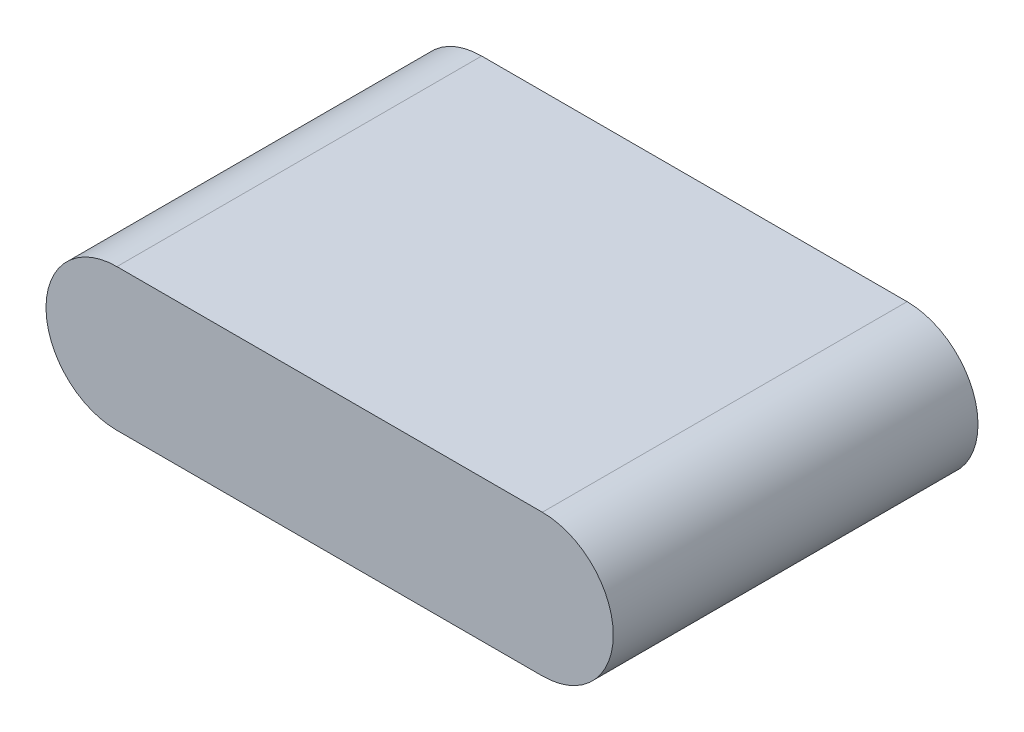
ISO-10303-21;
HEADER;
FILE_DESCRIPTION(('STEP AP214'),'2;1');
FILE_NAME('part.step','',(''),(''),'','','');
FILE_SCHEMA(('AUTOMOTIVE_DESIGN { 1 0 10303 214 1 1 1 1 }'));
ENDSEC;
DATA;
#1=APPLICATION_CONTEXT('core data for automotive mechanical design processes');
#2=APPLICATION_PROTOCOL_DEFINITION('international standard','automotive_design',2000,#1);
#3=PRODUCT_CONTEXT('',#1,'mechanical');
#4=PRODUCT('Part','Part','',(#3));
#5=PRODUCT_RELATED_PRODUCT_CATEGORY('part','',(#4));
#6=PRODUCT_DEFINITION_FORMATION('','',#4);
#7=PRODUCT_DEFINITION_CONTEXT('part definition',#1,'design');
#8=PRODUCT_DEFINITION('design','',#6,#7);
#9=PRODUCT_DEFINITION_SHAPE('','',#8);
#10=(LENGTH_UNIT() NAMED_UNIT(*) SI_UNIT(.MILLI.,.METRE.));
#11=(NAMED_UNIT(*) PLANE_ANGLE_UNIT() SI_UNIT($,.RADIAN.));
#12=(NAMED_UNIT(*) SI_UNIT($,.STERADIAN.) SOLID_ANGLE_UNIT());
#13=UNCERTAINTY_MEASURE_WITH_UNIT(LENGTH_MEASURE(1.E-05),#10,'distance_accuracy_value','');
#14=(GEOMETRIC_REPRESENTATION_CONTEXT(3) GLOBAL_UNCERTAINTY_ASSIGNED_CONTEXT((#13)) GLOBAL_UNIT_ASSIGNED_CONTEXT((#10,
#11,#12)) REPRESENTATION_CONTEXT('',''));
#15=CARTESIAN_POINT('',(0.,0.,0.));
#16=DIRECTION('',(0.,0.,1.));
#17=DIRECTION('',(1.,0.,0.));
#18=AXIS2_PLACEMENT_3D('',#15,#16,#17);
#19=CARTESIAN_POINT('',(5.404637108939,3.564658263321,0.));
#20=DIRECTION('',(0.,1.,0.));
#21=DIRECTION('',(0.,0.,1.));
#22=AXIS2_PLACEMENT_3D('',#19,#20,#21);
#23=PLANE('',#22);
#24=DIRECTION('',(1.,0.,0.));
#25=VECTOR('',#24,1.);
#26=CARTESIAN_POINT('',(5.346317108939,3.564658263321,0.1));
#27=LINE('',#26,#25);
#28=CARTESIAN_POINT('',(5.404637108939,3.564658263321,0.1));
#29=VERTEX_POINT('',#28);
#30=CARTESIAN_POINT('',(5.287997108939,3.564658263321,0.1));
#31=VERTEX_POINT('',#30);
#32=EDGE_CURVE('E83',#29,#31,#27,.F.);
#33=ORIENTED_EDGE('',*,*,#32,.F.);
#34=DIRECTION('',(0.,0.,1.));
#35=VECTOR('',#34,1.);
#36=CARTESIAN_POINT('',(5.404637108939,3.564658263321,0.));
#37=LINE('',#36,#35);
#38=CARTESIAN_POINT('',(5.404637108939,3.564658263321,0.));
#39=VERTEX_POINT('',#38);
#40=EDGE_CURVE('E65',#39,#29,#37,.T.);
#41=ORIENTED_EDGE('',*,*,#40,.F.);
#42=DIRECTION('',(1.,0.,0.));
#43=VECTOR('',#42,1.);
#44=CARTESIAN_POINT('',(5.346317108939,3.564658263321,0.));
#45=LINE('',#44,#43);
#46=CARTESIAN_POINT('',(5.287997108939,3.564658263321,0.));
#47=VERTEX_POINT('',#46);
#48=EDGE_CURVE('E61',#39,#47,#45,.F.);
#49=ORIENTED_EDGE('',*,*,#48,.T.);
#50=DIRECTION('',(0.,0.,1.));
#51=VECTOR('',#50,1.);
#52=CARTESIAN_POINT('',(5.287997108939,3.564658263321,0.));
#53=LINE('',#52,#51);
#54=EDGE_CURVE('E75',#31,#47,#53,.F.);
#55=ORIENTED_EDGE('',*,*,#54,.F.);
#56=EDGE_LOOP('',(#33,#41,#49,#55));
#57=FACE_BOUND('',#56,.T.);
#58=ADVANCED_FACE('F17',(#57),#23,.T.);
#59=CARTESIAN_POINT('',(5.346317108939,3.545218263321,0.));
#60=DIRECTION('',(0.,0.,1.));
#61=DIRECTION('',(1.,0.,0.));
#62=AXIS2_PLACEMENT_3D('',#59,#60,#61);
#63=PLANE('',#62);
#64=CARTESIAN_POINT('',(5.404637108939,3.545218263321,0.));
#65=DIRECTION('',(0.,0.,1.));
#66=DIRECTION('',(1.,0.,0.));
#67=AXIS2_PLACEMENT_3D('',#64,#65,#66);
#68=CIRCLE('',#67,0.01944);
#69=CARTESIAN_POINT('',(5.404637108939,3.525778263321,0.));
#70=VERTEX_POINT('',#69);
#71=EDGE_CURVE('E20',#70,#39,#68,.T.);
#72=ORIENTED_EDGE('',*,*,#71,.F.);
#73=DIRECTION('',(1.,0.,0.));
#74=VECTOR('',#73,1.);
#75=CARTESIAN_POINT('',(5.287997108939,3.525778263321,0.));
#76=LINE('',#75,#74);
#77=CARTESIAN_POINT('',(5.287997108939,3.525778263321,0.));
#78=VERTEX_POINT('',#77);
#79=EDGE_CURVE('E59',#78,#70,#76,.T.);
#80=ORIENTED_EDGE('',*,*,#79,.F.);
#81=CARTESIAN_POINT('',(5.287997108939,3.545218263321,0.));
#82=DIRECTION('',(0.,0.,1.));
#83=DIRECTION('',(1.,0.,0.));
#84=AXIS2_PLACEMENT_3D('',#81,#82,#83);
#85=CIRCLE('',#84,0.01944);
#86=EDGE_CURVE('E85',#47,#78,#85,.T.);
#87=ORIENTED_EDGE('',*,*,#86,.F.);
#88=ORIENTED_EDGE('',*,*,#48,.F.);
#89=EDGE_LOOP('',(#72,#80,#87,#88));
#90=FACE_BOUND('',#89,.T.);
#91=ADVANCED_FACE('F56',(#90),#63,.F.);
#92=CARTESIAN_POINT('',(5.404637108939,3.545218263321,0.));
#93=DIRECTION('',(0.,0.,1.));
#94=DIRECTION('',(1.,0.,0.));
#95=AXIS2_PLACEMENT_3D('',#92,#93,#94);
#96=CYLINDRICAL_SURFACE('',#95,0.01944);
#97=CARTESIAN_POINT('',(5.404637108939,3.545218263321,0.1));
#98=DIRECTION('',(0.,0.,1.));
#99=DIRECTION('',(1.,0.,0.));
#100=AXIS2_PLACEMENT_3D('',#97,#98,#99);
#101=CIRCLE('',#100,0.01944);
#102=CARTESIAN_POINT('',(5.404637108939,3.525778263321,0.1));
#103=VERTEX_POINT('',#102);
#104=EDGE_CURVE('E70',#103,#29,#101,.T.);
#105=ORIENTED_EDGE('',*,*,#104,.F.);
#106=DIRECTION('',(0.,0.,-1.));
#107=VECTOR('',#106,1.);
#108=CARTESIAN_POINT('',(5.404637108939,3.525778263321,0.));
#109=LINE('',#108,#107);
#110=EDGE_CURVE('E67',#70,#103,#109,.F.);
#111=ORIENTED_EDGE('',*,*,#110,.F.);
#112=ORIENTED_EDGE('',*,*,#71,.T.);
#113=ORIENTED_EDGE('',*,*,#40,.T.);
#114=EDGE_LOOP('',(#105,#111,#112,#113));
#115=FACE_BOUND('',#114,.T.);
#116=ADVANCED_FACE('F68',(#115),#96,.T.);
#117=CARTESIAN_POINT('',(5.346317108939,3.545218263321,0.1));
#118=DIRECTION('',(0.,0.,1.));
#119=DIRECTION('',(1.,0.,0.));
#120=AXIS2_PLACEMENT_3D('',#117,#118,#119);
#121=PLANE('',#120);
#122=DIRECTION('',(1.,0.,0.));
#123=VECTOR('',#122,1.);
#124=CARTESIAN_POINT('',(5.287997108939,3.525778263321,0.1));
#125=LINE('',#124,#123);
#126=CARTESIAN_POINT('',(5.287997108939,3.525778263321,0.1));
#127=VERTEX_POINT('',#126);
#128=EDGE_CURVE('E26',#103,#127,#125,.F.);
#129=ORIENTED_EDGE('',*,*,#128,.F.);
#130=ORIENTED_EDGE('',*,*,#104,.T.);
#131=ORIENTED_EDGE('',*,*,#32,.T.);
#132=CARTESIAN_POINT('',(5.287997108939,3.545218263321,0.1));
#133=DIRECTION('',(0.,0.,1.));
#134=DIRECTION('',(1.,0.,0.));
#135=AXIS2_PLACEMENT_3D('',#132,#133,#134);
#136=CIRCLE('',#135,0.01944);
#137=EDGE_CURVE('E35',#127,#31,#136,.F.);
#138=ORIENTED_EDGE('',*,*,#137,.F.);
#139=EDGE_LOOP('',(#129,#130,#131,#138));
#140=FACE_BOUND('',#139,.T.);
#141=ADVANCED_FACE('F88',(#140),#121,.T.);
#142=CARTESIAN_POINT('',(5.287997108939,3.545218263321,0.));
#143=DIRECTION('',(0.,0.,1.));
#144=DIRECTION('',(1.,0.,0.));
#145=AXIS2_PLACEMENT_3D('',#142,#143,#144);
#146=CYLINDRICAL_SURFACE('',#145,0.01944);
#147=ORIENTED_EDGE('',*,*,#137,.T.);
#148=ORIENTED_EDGE('',*,*,#54,.T.);
#149=ORIENTED_EDGE('',*,*,#86,.T.);
#150=DIRECTION('',(0.,0.,-1.));
#151=VECTOR('',#150,1.);
#152=CARTESIAN_POINT('',(5.287997108939,3.525778263321,0.));
#153=LINE('',#152,#151);
#154=EDGE_CURVE('E11',#127,#78,#153,.T.);
#155=ORIENTED_EDGE('',*,*,#154,.F.);
#156=EDGE_LOOP('',(#147,#148,#149,#155));
#157=FACE_BOUND('',#156,.T.);
#158=ADVANCED_FACE('F90',(#157),#146,.T.);
#159=CARTESIAN_POINT('',(5.287997108939,3.525778263321,0.));
#160=DIRECTION('',(0.,-1.,0.));
#161=DIRECTION('',(0.,0.,-1.));
#162=AXIS2_PLACEMENT_3D('',#159,#160,#161);
#163=PLANE('',#162);
#164=ORIENTED_EDGE('',*,*,#128,.T.);
#165=ORIENTED_EDGE('',*,*,#154,.T.);
#166=ORIENTED_EDGE('',*,*,#79,.T.);
#167=ORIENTED_EDGE('',*,*,#110,.T.);
#168=EDGE_LOOP('',(#164,#165,#166,#167));
#169=FACE_BOUND('',#168,.T.);
#170=ADVANCED_FACE('F74',(#169),#163,.T.);
#171=CLOSED_SHELL('',(#58,#91,#116,#141,#158,#170));
#172=MANIFOLD_SOLID_BREP('B1',#171);
#173=ADVANCED_BREP_SHAPE_REPRESENTATION('',(#18,#172),#14);
#174=SHAPE_DEFINITION_REPRESENTATION(#9,#173);
ENDSEC;
END-ISO-10303-21;
